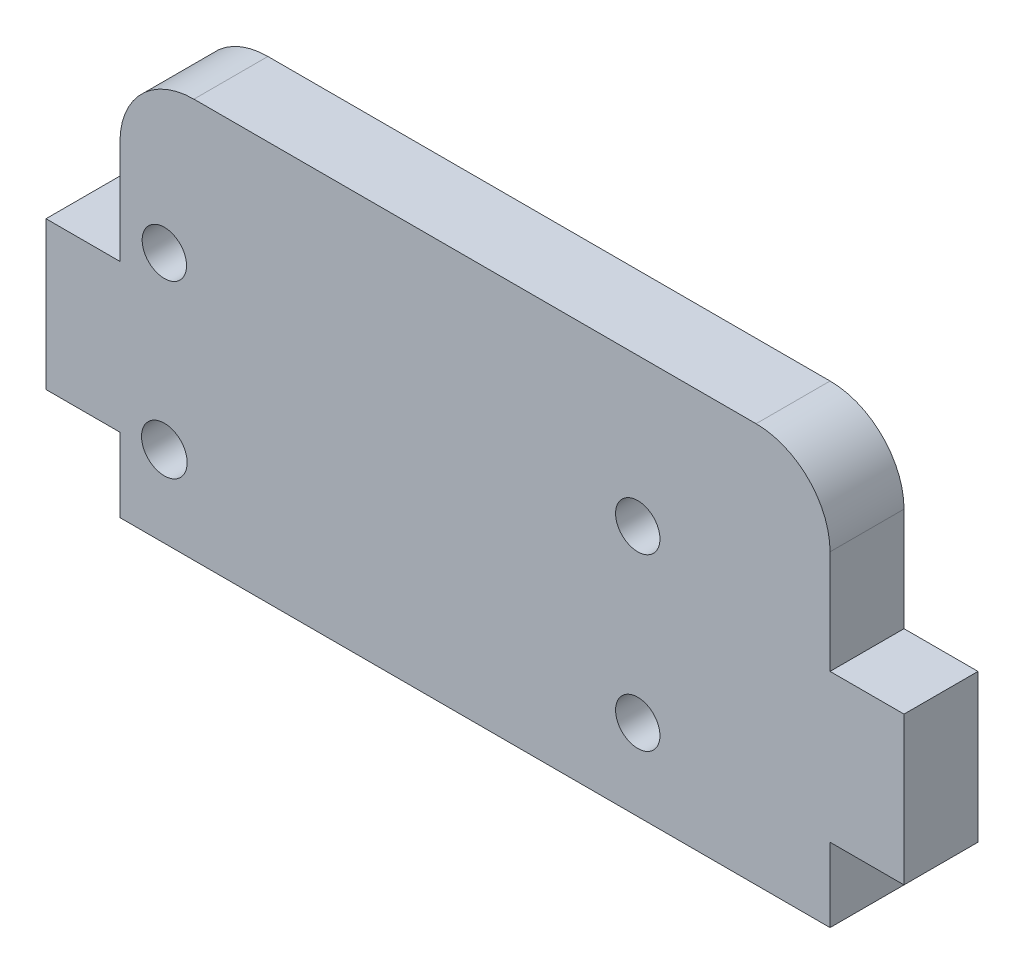
ISO-10303-21;
HEADER;
FILE_DESCRIPTION(('STEP AP214'),'2;1');
FILE_NAME('part.step','',(''),(''),'','','');
FILE_SCHEMA(('AUTOMOTIVE_DESIGN { 1 0 10303 214 1 1 1 1 }'));
ENDSEC;
DATA;
#1=APPLICATION_CONTEXT('core data for automotive mechanical design processes');
#2=APPLICATION_PROTOCOL_DEFINITION('international standard','automotive_design',2000,#1);
#3=PRODUCT_CONTEXT('',#1,'mechanical');
#4=PRODUCT('Part','Part','',(#3));
#5=PRODUCT_RELATED_PRODUCT_CATEGORY('part','',(#4));
#6=PRODUCT_DEFINITION_FORMATION('','',#4);
#7=PRODUCT_DEFINITION_CONTEXT('part definition',#1,'design');
#8=PRODUCT_DEFINITION('design','',#6,#7);
#9=PRODUCT_DEFINITION_SHAPE('','',#8);
#10=(LENGTH_UNIT() NAMED_UNIT(*) SI_UNIT(.MILLI.,.METRE.));
#11=(NAMED_UNIT(*) PLANE_ANGLE_UNIT() SI_UNIT($,.RADIAN.));
#12=(NAMED_UNIT(*) SI_UNIT($,.STERADIAN.) SOLID_ANGLE_UNIT());
#13=UNCERTAINTY_MEASURE_WITH_UNIT(LENGTH_MEASURE(1.E-05),#10,'distance_accuracy_value','');
#14=(GEOMETRIC_REPRESENTATION_CONTEXT(3) GLOBAL_UNCERTAINTY_ASSIGNED_CONTEXT((#13)) GLOBAL_UNIT_ASSIGNED_CONTEXT((#10,
#11,#12)) REPRESENTATION_CONTEXT('',''));
#15=CARTESIAN_POINT('',(0.,0.,0.));
#16=DIRECTION('',(0.,0.,1.));
#17=DIRECTION('',(1.,0.,0.));
#18=AXIS2_PLACEMENT_3D('',#15,#16,#17);
#19=CARTESIAN_POINT('',(23.2664756446991,22.,5.));
#20=DIRECTION('',(0.,0.,-1.));
#21=DIRECTION('',(-1.,0.,0.));
#22=AXIS2_PLACEMENT_3D('',#19,#20,#21);
#23=CYLINDRICAL_SURFACE('',#22,5.);
#24=DIRECTION('',(0.,0.,-1.));
#25=VECTOR('',#24,1.);
#26=CARTESIAN_POINT('',(23.2664756446991,27.,5.));
#27=LINE('',#26,#25);
#28=CARTESIAN_POINT('',(23.2664756446991,27.,5.));
#29=VERTEX_POINT('',#28);
#30=CARTESIAN_POINT('',(23.2664756446991,27.,0.));
#31=VERTEX_POINT('',#30);
#32=EDGE_CURVE('E174',#29,#31,#27,.T.);
#33=ORIENTED_EDGE('',*,*,#32,.F.);
#34=CARTESIAN_POINT('',(23.2664756446991,22.,5.));
#35=DIRECTION('',(0.,0.,1.));
#36=DIRECTION('',(1.,0.,0.));
#37=AXIS2_PLACEMENT_3D('',#34,#35,#36);
#38=CIRCLE('',#37,5.);
#39=CARTESIAN_POINT('',(28.2664756446991,22.,5.));
#40=VERTEX_POINT('',#39);
#41=EDGE_CURVE('E40',#40,#29,#38,.T.);
#42=ORIENTED_EDGE('',*,*,#41,.F.);
#43=DIRECTION('',(0.,0.,-1.));
#44=VECTOR('',#43,1.);
#45=CARTESIAN_POINT('',(28.2664756446991,22.,5.));
#46=LINE('',#45,#44);
#47=CARTESIAN_POINT('',(28.2664756446991,22.,0.));
#48=VERTEX_POINT('',#47);
#49=EDGE_CURVE('E177',#48,#40,#46,.F.);
#50=ORIENTED_EDGE('',*,*,#49,.F.);
#51=CARTESIAN_POINT('',(23.2664756446991,22.,0.));
#52=DIRECTION('',(0.,0.,1.));
#53=DIRECTION('',(1.,0.,0.));
#54=AXIS2_PLACEMENT_3D('',#51,#52,#53);
#55=CIRCLE('',#54,5.);
#56=EDGE_CURVE('E11',#31,#48,#55,.F.);
#57=ORIENTED_EDGE('',*,*,#56,.F.);
#58=EDGE_LOOP('',(#33,#42,#50,#57));
#59=FACE_BOUND('',#58,.T.);
#60=ADVANCED_FACE('F33',(#59),#23,.T.);
#61=CARTESIAN_POINT('',(-14.7335243553009,22.,5.));
#62=DIRECTION('',(0.,0.,1.));
#63=DIRECTION('',(1.,0.,0.));
#64=AXIS2_PLACEMENT_3D('',#61,#62,#63);
#65=CYLINDRICAL_SURFACE('',#64,5.);
#66=DIRECTION('',(0.,0.,1.));
#67=VECTOR('',#66,1.);
#68=CARTESIAN_POINT('',(-14.7335243553009,27.,5.));
#69=LINE('',#68,#67);
#70=CARTESIAN_POINT('',(-14.7335243553009,27.,0.));
#71=VERTEX_POINT('',#70);
#72=CARTESIAN_POINT('',(-14.7335243553009,27.,5.));
#73=VERTEX_POINT('',#72);
#74=EDGE_CURVE('E158',#71,#73,#69,.T.);
#75=ORIENTED_EDGE('',*,*,#74,.F.);
#76=CARTESIAN_POINT('',(-14.7335243553009,22.,0.));
#77=DIRECTION('',(0.,0.,1.));
#78=DIRECTION('',(1.,0.,0.));
#79=AXIS2_PLACEMENT_3D('',#76,#77,#78);
#80=CIRCLE('',#79,5.);
#81=CARTESIAN_POINT('',(-19.7335243553009,22.,0.));
#82=VERTEX_POINT('',#81);
#83=EDGE_CURVE('E169',#82,#71,#80,.F.);
#84=ORIENTED_EDGE('',*,*,#83,.F.);
#85=DIRECTION('',(0.,0.,1.));
#86=VECTOR('',#85,1.);
#87=CARTESIAN_POINT('',(-19.7335243553009,22.,5.));
#88=LINE('',#87,#86);
#89=CARTESIAN_POINT('',(-19.7335243553009,22.,5.));
#90=VERTEX_POINT('',#89);
#91=EDGE_CURVE('E161',#90,#82,#88,.F.);
#92=ORIENTED_EDGE('',*,*,#91,.F.);
#93=CARTESIAN_POINT('',(-14.7335243553009,22.,5.));
#94=DIRECTION('',(0.,0.,1.));
#95=DIRECTION('',(1.,0.,0.));
#96=AXIS2_PLACEMENT_3D('',#93,#94,#95);
#97=CIRCLE('',#96,5.);
#98=EDGE_CURVE('E172',#73,#90,#97,.T.);
#99=ORIENTED_EDGE('',*,*,#98,.F.);
#100=EDGE_LOOP('',(#75,#84,#92,#99));
#101=FACE_BOUND('',#100,.T.);
#102=ADVANCED_FACE('F296',(#101),#65,.T.);
#103=CARTESIAN_POINT('',(0.,0.,5.));
#104=DIRECTION('',(0.,0.,1.));
#105=DIRECTION('',(1.,0.,0.));
#106=AXIS2_PLACEMENT_3D('',#103,#104,#105);
#107=PLANE('',#106);
#108=CARTESIAN_POINT('',(-16.7335243553009,17.,5.));
#109=DIRECTION('',(0.,0.,1.));
#110=DIRECTION('',(1.,0.,0.));
#111=AXIS2_PLACEMENT_3D('',#108,#109,#110);
#112=CIRCLE('',#111,1.5);
#113=CARTESIAN_POINT('',(-15.2335243553009,17.,5.));
#114=VERTEX_POINT('',#113);
#115=EDGE_CURVE('E277',#114,#114,#112,.T.);
#116=ORIENTED_EDGE('',*,*,#115,.F.);
#117=EDGE_LOOP('',(#116));
#118=FACE_BOUND('',#117,.T.);
#119=CARTESIAN_POINT('',(-16.7335243563212,5.48859934850113,5.));
#120=DIRECTION('',(0.,0.,1.));
#121=DIRECTION('',(1.,0.,0.));
#122=AXIS2_PLACEMENT_3D('',#119,#120,#121);
#123=CIRCLE('',#122,1.54291872443539);
#124=CARTESIAN_POINT('',(-15.1906056318858,5.48859934850113,5.));
#125=VERTEX_POINT('',#124);
#126=EDGE_CURVE('E201',#125,#125,#123,.T.);
#127=ORIENTED_EDGE('',*,*,#126,.F.);
#128=EDGE_LOOP('',(#127));
#129=FACE_BOUND('',#128,.T.);
#130=DIRECTION('',(0.,1.,0.));
#131=VECTOR('',#130,1.);
#132=CARTESIAN_POINT('',(28.2664756446991,15.,5.));
#133=LINE('',#132,#131);
#134=CARTESIAN_POINT('',(28.2664756446991,15.,5.));
#135=VERTEX_POINT('',#134);
#136=EDGE_CURVE('E182',#135,#40,#133,.T.);
#137=ORIENTED_EDGE('',*,*,#136,.T.);
#138=ORIENTED_EDGE('',*,*,#41,.T.);
#139=DIRECTION('',(-1.,0.,0.));
#140=VECTOR('',#139,1.);
#141=CARTESIAN_POINT('',(-19.7335243553009,27.,5.));
#142=LINE('',#141,#140);
#143=EDGE_CURVE('E179',#29,#73,#142,.T.);
#144=ORIENTED_EDGE('',*,*,#143,.T.);
#145=ORIENTED_EDGE('',*,*,#98,.T.);
#146=DIRECTION('',(0.,-1.,0.));
#147=VECTOR('',#146,1.);
#148=CARTESIAN_POINT('',(-19.7335243553009,15.,5.));
#149=LINE('',#148,#147);
#150=CARTESIAN_POINT('',(-19.7335243553009,15.,5.));
#151=VERTEX_POINT('',#150);
#152=EDGE_CURVE('E186',#90,#151,#149,.T.);
#153=ORIENTED_EDGE('',*,*,#152,.T.);
#154=DIRECTION('',(-1.,0.,0.));
#155=VECTOR('',#154,1.);
#156=CARTESIAN_POINT('',(-24.7335243553009,15.,5.));
#157=LINE('',#156,#155);
#158=CARTESIAN_POINT('',(-24.7335243553009,15.,5.));
#159=VERTEX_POINT('',#158);
#160=EDGE_CURVE('E188',#151,#159,#157,.T.);
#161=ORIENTED_EDGE('',*,*,#160,.T.);
#162=DIRECTION('',(0.,-1.,0.));
#163=VECTOR('',#162,1.);
#164=CARTESIAN_POINT('',(-24.7335243553009,5.,5.));
#165=LINE('',#164,#163);
#166=CARTESIAN_POINT('',(-24.7335243553009,5.,5.));
#167=VERTEX_POINT('',#166);
#168=EDGE_CURVE('E195',#159,#167,#165,.T.);
#169=ORIENTED_EDGE('',*,*,#168,.T.);
#170=DIRECTION('',(1.,0.,0.));
#171=VECTOR('',#170,1.);
#172=CARTESIAN_POINT('',(-19.7335243553009,5.,5.));
#173=LINE('',#172,#171);
#174=CARTESIAN_POINT('',(-19.7335243553009,5.,5.));
#175=VERTEX_POINT('',#174);
#176=EDGE_CURVE('E149',#167,#175,#173,.T.);
#177=ORIENTED_EDGE('',*,*,#176,.T.);
#178=DIRECTION('',(0.,-1.,0.));
#179=VECTOR('',#178,1.);
#180=CARTESIAN_POINT('',(-19.7335243553009,0.,5.));
#181=LINE('',#180,#179);
#182=CARTESIAN_POINT('',(-19.7335243553009,0.,5.));
#183=VERTEX_POINT('',#182);
#184=EDGE_CURVE('E142',#175,#183,#181,.T.);
#185=ORIENTED_EDGE('',*,*,#184,.T.);
#186=DIRECTION('',(1.,0.,0.));
#187=VECTOR('',#186,1.);
#188=CARTESIAN_POINT('',(-19.7335243553009,0.,5.));
#189=LINE('',#188,#187);
#190=CARTESIAN_POINT('',(28.2664756446991,0.,5.));
#191=VERTEX_POINT('',#190);
#192=EDGE_CURVE('E131',#183,#191,#189,.T.);
#193=ORIENTED_EDGE('',*,*,#192,.T.);
#194=DIRECTION('',(0.,1.,0.));
#195=VECTOR('',#194,1.);
#196=CARTESIAN_POINT('',(28.2664756446991,0.,5.));
#197=LINE('',#196,#195);
#198=CARTESIAN_POINT('',(28.2664756446991,5.,5.));
#199=VERTEX_POINT('',#198);
#200=EDGE_CURVE('E141',#191,#199,#197,.T.);
#201=ORIENTED_EDGE('',*,*,#200,.T.);
#202=DIRECTION('',(1.,0.,0.));
#203=VECTOR('',#202,1.);
#204=CARTESIAN_POINT('',(28.2664756446991,5.,5.));
#205=LINE('',#204,#203);
#206=CARTESIAN_POINT('',(33.2664756446991,5.,5.));
#207=VERTEX_POINT('',#206);
#208=EDGE_CURVE('E248',#199,#207,#205,.T.);
#209=ORIENTED_EDGE('',*,*,#208,.T.);
#210=DIRECTION('',(0.,1.,0.));
#211=VECTOR('',#210,1.);
#212=CARTESIAN_POINT('',(33.2664756446991,5.,5.));
#213=LINE('',#212,#211);
#214=CARTESIAN_POINT('',(33.2664756446991,15.,5.));
#215=VERTEX_POINT('',#214);
#216=EDGE_CURVE('E263',#207,#215,#213,.T.);
#217=ORIENTED_EDGE('',*,*,#216,.T.);
#218=DIRECTION('',(-1.,0.,0.));
#219=VECTOR('',#218,1.);
#220=CARTESIAN_POINT('',(33.2664756446991,15.,5.));
#221=LINE('',#220,#219);
#222=EDGE_CURVE('E190',#215,#135,#221,.T.);
#223=ORIENTED_EDGE('',*,*,#222,.T.);
#224=EDGE_LOOP('',(#137,#138,#144,#145,#153,#161,#169,#177,#185,#193,#201,#209,#217,#223));
#225=FACE_BOUND('',#224,.T.);
#226=CARTESIAN_POINT('',(15.2664756436836,16.9999999999535,5.));
#227=DIRECTION('',(0.,0.,1.));
#228=DIRECTION('',(1.,0.,0.));
#229=AXIS2_PLACEMENT_3D('',#226,#227,#228);
#230=CIRCLE('',#229,1.50000000099755);
#231=CARTESIAN_POINT('',(16.7664756446812,16.9999999999535,5.));
#232=VERTEX_POINT('',#231);
#233=EDGE_CURVE('E271',#232,#232,#230,.T.);
#234=ORIENTED_EDGE('',*,*,#233,.F.);
#235=EDGE_LOOP('',(#234));
#236=FACE_BOUND('',#235,.T.);
#237=CARTESIAN_POINT('',(15.2664756436788,5.48859934848776,5.));
#238=DIRECTION('',(0.,0.,1.));
#239=DIRECTION('',(1.,0.,0.));
#240=AXIS2_PLACEMENT_3D('',#237,#238,#239);
#241=CIRCLE('',#240,1.50000000100247);
#242=CARTESIAN_POINT('',(16.7664756446813,5.48859934848776,5.));
#243=VERTEX_POINT('',#242);
#244=EDGE_CURVE('E283',#243,#243,#241,.T.);
#245=ORIENTED_EDGE('',*,*,#244,.F.);
#246=EDGE_LOOP('',(#245));
#247=FACE_BOUND('',#246,.T.);
#248=ADVANCED_FACE('F146',(#118,#129,#225,#236,#247),#107,.T.);
#249=CARTESIAN_POINT('',(0.,0.,0.));
#250=DIRECTION('',(0.,0.,1.));
#251=DIRECTION('',(1.,0.,0.));
#252=AXIS2_PLACEMENT_3D('',#249,#250,#251);
#253=PLANE('',#252);
#254=DIRECTION('',(-1.,0.,0.));
#255=VECTOR('',#254,1.);
#256=CARTESIAN_POINT('',(-19.7335243553009,27.,0.));
#257=LINE('',#256,#255);
#258=EDGE_CURVE('E214',#31,#71,#257,.T.);
#259=ORIENTED_EDGE('',*,*,#258,.F.);
#260=ORIENTED_EDGE('',*,*,#56,.T.);
#261=DIRECTION('',(0.,1.,0.));
#262=VECTOR('',#261,1.);
#263=CARTESIAN_POINT('',(28.2664756446991,15.,0.));
#264=LINE('',#263,#262);
#265=CARTESIAN_POINT('',(28.2664756446991,15.,0.));
#266=VERTEX_POINT('',#265);
#267=EDGE_CURVE('E211',#266,#48,#264,.T.);
#268=ORIENTED_EDGE('',*,*,#267,.F.);
#269=DIRECTION('',(-1.,0.,0.));
#270=VECTOR('',#269,1.);
#271=CARTESIAN_POINT('',(33.2664756446991,15.,0.));
#272=LINE('',#271,#270);
#273=CARTESIAN_POINT('',(33.2664756446991,15.,0.));
#274=VERTEX_POINT('',#273);
#275=EDGE_CURVE('E209',#274,#266,#272,.T.);
#276=ORIENTED_EDGE('',*,*,#275,.F.);
#277=DIRECTION('',(0.,1.,0.));
#278=VECTOR('',#277,1.);
#279=CARTESIAN_POINT('',(33.2664756446991,5.,0.));
#280=LINE('',#279,#278);
#281=CARTESIAN_POINT('',(33.2664756446991,5.,0.));
#282=VERTEX_POINT('',#281);
#283=EDGE_CURVE('E207',#282,#274,#280,.T.);
#284=ORIENTED_EDGE('',*,*,#283,.F.);
#285=DIRECTION('',(1.,0.,0.));
#286=VECTOR('',#285,1.);
#287=CARTESIAN_POINT('',(28.2664756446991,5.,0.));
#288=LINE('',#287,#286);
#289=CARTESIAN_POINT('',(28.2664756446991,5.,0.));
#290=VERTEX_POINT('',#289);
#291=EDGE_CURVE('E205',#290,#282,#288,.T.);
#292=ORIENTED_EDGE('',*,*,#291,.F.);
#293=DIRECTION('',(0.,1.,0.));
#294=VECTOR('',#293,1.);
#295=CARTESIAN_POINT('',(28.2664756446991,0.,0.));
#296=LINE('',#295,#294);
#297=CARTESIAN_POINT('',(28.2664756446991,0.,0.));
#298=VERTEX_POINT('',#297);
#299=EDGE_CURVE('E203',#298,#290,#296,.T.);
#300=ORIENTED_EDGE('',*,*,#299,.F.);
#301=DIRECTION('',(1.,0.,0.));
#302=VECTOR('',#301,1.);
#303=CARTESIAN_POINT('',(-19.7335243553009,0.,0.));
#304=LINE('',#303,#302);
#305=CARTESIAN_POINT('',(-19.7335243553009,0.,0.));
#306=VERTEX_POINT('',#305);
#307=EDGE_CURVE('E200',#306,#298,#304,.T.);
#308=ORIENTED_EDGE('',*,*,#307,.F.);
#309=DIRECTION('',(0.,-1.,0.));
#310=VECTOR('',#309,1.);
#311=CARTESIAN_POINT('',(-19.7335243553009,0.,0.));
#312=LINE('',#311,#310);
#313=CARTESIAN_POINT('',(-19.7335243553009,5.,0.));
#314=VERTEX_POINT('',#313);
#315=EDGE_CURVE('E157',#314,#306,#312,.T.);
#316=ORIENTED_EDGE('',*,*,#315,.F.);
#317=DIRECTION('',(1.,0.,0.));
#318=VECTOR('',#317,1.);
#319=CARTESIAN_POINT('',(-19.7335243553009,5.,0.));
#320=LINE('',#319,#318);
#321=CARTESIAN_POINT('',(-24.7335243553009,5.,0.));
#322=VERTEX_POINT('',#321);
#323=EDGE_CURVE('E153',#322,#314,#320,.T.);
#324=ORIENTED_EDGE('',*,*,#323,.F.);
#325=DIRECTION('',(0.,-1.,0.));
#326=VECTOR('',#325,1.);
#327=CARTESIAN_POINT('',(-24.7335243553009,5.,0.));
#328=LINE('',#327,#326);
#329=CARTESIAN_POINT('',(-24.7335243553009,15.,0.));
#330=VERTEX_POINT('',#329);
#331=EDGE_CURVE('E220',#330,#322,#328,.T.);
#332=ORIENTED_EDGE('',*,*,#331,.F.);
#333=DIRECTION('',(-1.,0.,0.));
#334=VECTOR('',#333,1.);
#335=CARTESIAN_POINT('',(-24.7335243553009,15.,0.));
#336=LINE('',#335,#334);
#337=CARTESIAN_POINT('',(-19.7335243553009,15.,0.));
#338=VERTEX_POINT('',#337);
#339=EDGE_CURVE('E218',#338,#330,#336,.T.);
#340=ORIENTED_EDGE('',*,*,#339,.F.);
#341=DIRECTION('',(0.,-1.,0.));
#342=VECTOR('',#341,1.);
#343=CARTESIAN_POINT('',(-19.7335243553009,15.,0.));
#344=LINE('',#343,#342);
#345=EDGE_CURVE('E216',#82,#338,#344,.T.);
#346=ORIENTED_EDGE('',*,*,#345,.F.);
#347=ORIENTED_EDGE('',*,*,#83,.T.);
#348=EDGE_LOOP('',(#259,#260,#268,#276,#284,#292,#300,#308,#316,#324,#332,#340,#346,#347));
#349=FACE_BOUND('',#348,.T.);
#350=CARTESIAN_POINT('',(-16.7335243563212,5.48859934850113,0.));
#351=DIRECTION('',(0.,0.,1.));
#352=DIRECTION('',(1.,0.,0.));
#353=AXIS2_PLACEMENT_3D('',#350,#351,#352);
#354=CIRCLE('',#353,1.54291872443539);
#355=CARTESIAN_POINT('',(-15.1906056318858,5.48859934850113,0.));
#356=VERTEX_POINT('',#355);
#357=EDGE_CURVE('E268',#356,#356,#354,.T.);
#358=ORIENTED_EDGE('',*,*,#357,.T.);
#359=EDGE_LOOP('',(#358));
#360=FACE_BOUND('',#359,.T.);
#361=CARTESIAN_POINT('',(15.2664756436836,16.9999999999535,0.));
#362=DIRECTION('',(0.,0.,1.));
#363=DIRECTION('',(1.,0.,0.));
#364=AXIS2_PLACEMENT_3D('',#361,#362,#363);
#365=CIRCLE('',#364,1.50000000099755);
#366=CARTESIAN_POINT('',(16.7664756446812,16.9999999999535,0.));
#367=VERTEX_POINT('',#366);
#368=EDGE_CURVE('E274',#367,#367,#365,.T.);
#369=ORIENTED_EDGE('',*,*,#368,.T.);
#370=EDGE_LOOP('',(#369));
#371=FACE_BOUND('',#370,.T.);
#372=CARTESIAN_POINT('',(-16.7335243553009,17.,0.));
#373=DIRECTION('',(0.,0.,1.));
#374=DIRECTION('',(1.,0.,0.));
#375=AXIS2_PLACEMENT_3D('',#372,#373,#374);
#376=CIRCLE('',#375,1.5);
#377=CARTESIAN_POINT('',(-15.2335243553009,17.,0.));
#378=VERTEX_POINT('',#377);
#379=EDGE_CURVE('E280',#378,#378,#376,.T.);
#380=ORIENTED_EDGE('',*,*,#379,.T.);
#381=EDGE_LOOP('',(#380));
#382=FACE_BOUND('',#381,.T.);
#383=CARTESIAN_POINT('',(15.2664756436788,5.48859934848776,0.));
#384=DIRECTION('',(0.,0.,1.));
#385=DIRECTION('',(1.,0.,0.));
#386=AXIS2_PLACEMENT_3D('',#383,#384,#385);
#387=CIRCLE('',#386,1.50000000100247);
#388=CARTESIAN_POINT('',(16.7664756446813,5.48859934848776,0.));
#389=VERTEX_POINT('',#388);
#390=EDGE_CURVE('E286',#389,#389,#387,.T.);
#391=ORIENTED_EDGE('',*,*,#390,.T.);
#392=EDGE_LOOP('',(#391));
#393=FACE_BOUND('',#392,.T.);
#394=ADVANCED_FACE('F252',(#349,#360,#371,#382,#393),#253,.F.);
#395=CARTESIAN_POINT('',(-19.7335243553009,0.,5.));
#396=DIRECTION('',(1.,0.,0.));
#397=DIRECTION('',(0.,1.,0.));
#398=AXIS2_PLACEMENT_3D('',#395,#396,#397);
#399=PLANE('',#398);
#400=ORIENTED_EDGE('',*,*,#315,.T.);
#401=DIRECTION('',(0.,0.,-1.));
#402=VECTOR('',#401,1.);
#403=CARTESIAN_POINT('',(-19.7335243553009,0.,5.));
#404=LINE('',#403,#402);
#405=EDGE_CURVE('E135',#183,#306,#404,.T.);
#406=ORIENTED_EDGE('',*,*,#405,.F.);
#407=ORIENTED_EDGE('',*,*,#184,.F.);
#408=DIRECTION('',(0.,0.,-1.));
#409=VECTOR('',#408,1.);
#410=CARTESIAN_POINT('',(-19.7335243553009,5.,5.));
#411=LINE('',#410,#409);
#412=EDGE_CURVE('E198',#175,#314,#411,.T.);
#413=ORIENTED_EDGE('',*,*,#412,.T.);
#414=EDGE_LOOP('',(#400,#406,#407,#413));
#415=FACE_BOUND('',#414,.T.);
#416=ADVANCED_FACE('F155',(#415),#399,.F.);
#417=CARTESIAN_POINT('',(-19.7335243553009,0.,5.));
#418=DIRECTION('',(0.,1.,0.));
#419=DIRECTION('',(0.,0.,1.));
#420=AXIS2_PLACEMENT_3D('',#417,#418,#419);
#421=PLANE('',#420);
#422=ORIENTED_EDGE('',*,*,#307,.T.);
#423=DIRECTION('',(0.,0.,-1.));
#424=VECTOR('',#423,1.);
#425=CARTESIAN_POINT('',(28.2664756446991,0.,5.));
#426=LINE('',#425,#424);
#427=EDGE_CURVE('E138',#191,#298,#426,.T.);
#428=ORIENTED_EDGE('',*,*,#427,.F.);
#429=ORIENTED_EDGE('',*,*,#192,.F.);
#430=ORIENTED_EDGE('',*,*,#405,.T.);
#431=EDGE_LOOP('',(#422,#428,#429,#430));
#432=FACE_BOUND('',#431,.T.);
#433=ADVANCED_FACE('F133',(#432),#421,.F.);
#434=CARTESIAN_POINT('',(28.2664756446991,0.,5.));
#435=DIRECTION('',(-1.,0.,0.));
#436=DIRECTION('',(0.,-1.,0.));
#437=AXIS2_PLACEMENT_3D('',#434,#435,#436);
#438=PLANE('',#437);
#439=ORIENTED_EDGE('',*,*,#299,.T.);
#440=DIRECTION('',(0.,0.,-1.));
#441=VECTOR('',#440,1.);
#442=CARTESIAN_POINT('',(28.2664756446991,5.,5.));
#443=LINE('',#442,#441);
#444=EDGE_CURVE('E163',#199,#290,#443,.T.);
#445=ORIENTED_EDGE('',*,*,#444,.F.);
#446=ORIENTED_EDGE('',*,*,#200,.F.);
#447=ORIENTED_EDGE('',*,*,#427,.T.);
#448=EDGE_LOOP('',(#439,#445,#446,#447));
#449=FACE_BOUND('',#448,.T.);
#450=ADVANCED_FACE('F425',(#449),#438,.F.);
#451=CARTESIAN_POINT('',(28.2664756446991,5.,5.));
#452=DIRECTION('',(0.,1.,0.));
#453=DIRECTION('',(0.,0.,1.));
#454=AXIS2_PLACEMENT_3D('',#451,#452,#453);
#455=PLANE('',#454);
#456=ORIENTED_EDGE('',*,*,#291,.T.);
#457=DIRECTION('',(0.,0.,-1.));
#458=VECTOR('',#457,1.);
#459=CARTESIAN_POINT('',(33.2664756446991,5.,5.));
#460=LINE('',#459,#458);
#461=EDGE_CURVE('E239',#207,#282,#460,.T.);
#462=ORIENTED_EDGE('',*,*,#461,.F.);
#463=ORIENTED_EDGE('',*,*,#208,.F.);
#464=ORIENTED_EDGE('',*,*,#444,.T.);
#465=EDGE_LOOP('',(#456,#462,#463,#464));
#466=FACE_BOUND('',#465,.T.);
#467=ADVANCED_FACE('F246',(#466),#455,.F.);
#468=CARTESIAN_POINT('',(33.2664756446991,5.,5.));
#469=DIRECTION('',(-1.,0.,0.));
#470=DIRECTION('',(0.,0.,1.));
#471=AXIS2_PLACEMENT_3D('',#468,#469,#470);
#472=PLANE('',#471);
#473=ORIENTED_EDGE('',*,*,#283,.T.);
#474=DIRECTION('',(0.,0.,-1.));
#475=VECTOR('',#474,1.);
#476=CARTESIAN_POINT('',(33.2664756446991,15.,5.));
#477=LINE('',#476,#475);
#478=EDGE_CURVE('E236',#215,#274,#477,.T.);
#479=ORIENTED_EDGE('',*,*,#478,.F.);
#480=ORIENTED_EDGE('',*,*,#216,.F.);
#481=ORIENTED_EDGE('',*,*,#461,.T.);
#482=EDGE_LOOP('',(#473,#479,#480,#481));
#483=FACE_BOUND('',#482,.T.);
#484=ADVANCED_FACE('F257',(#483),#472,.F.);
#485=CARTESIAN_POINT('',(33.2664756446991,15.,5.));
#486=DIRECTION('',(0.,-1.,0.));
#487=DIRECTION('',(0.,0.,-1.));
#488=AXIS2_PLACEMENT_3D('',#485,#486,#487);
#489=PLANE('',#488);
#490=ORIENTED_EDGE('',*,*,#275,.T.);
#491=DIRECTION('',(0.,0.,-1.));
#492=VECTOR('',#491,1.);
#493=CARTESIAN_POINT('',(28.2664756446991,15.,5.));
#494=LINE('',#493,#492);
#495=EDGE_CURVE('E233',#135,#266,#494,.T.);
#496=ORIENTED_EDGE('',*,*,#495,.F.);
#497=ORIENTED_EDGE('',*,*,#222,.F.);
#498=ORIENTED_EDGE('',*,*,#478,.T.);
#499=EDGE_LOOP('',(#490,#496,#497,#498));
#500=FACE_BOUND('',#499,.T.);
#501=ADVANCED_FACE('F261',(#500),#489,.F.);
#502=CARTESIAN_POINT('',(28.2664756446991,15.,5.));
#503=DIRECTION('',(-1.,0.,0.));
#504=DIRECTION('',(0.,-1.,0.));
#505=AXIS2_PLACEMENT_3D('',#502,#503,#504);
#506=PLANE('',#505);
#507=ORIENTED_EDGE('',*,*,#267,.T.);
#508=ORIENTED_EDGE('',*,*,#49,.T.);
#509=ORIENTED_EDGE('',*,*,#136,.F.);
#510=ORIENTED_EDGE('',*,*,#495,.T.);
#511=EDGE_LOOP('',(#507,#508,#509,#510));
#512=FACE_BOUND('',#511,.T.);
#513=ADVANCED_FACE('F416',(#512),#506,.F.);
#514=CARTESIAN_POINT('',(-19.7335243553009,27.,5.));
#515=DIRECTION('',(0.,-1.,0.));
#516=DIRECTION('',(0.,0.,-1.));
#517=AXIS2_PLACEMENT_3D('',#514,#515,#516);
#518=PLANE('',#517);
#519=ORIENTED_EDGE('',*,*,#143,.F.);
#520=ORIENTED_EDGE('',*,*,#32,.T.);
#521=ORIENTED_EDGE('',*,*,#258,.T.);
#522=ORIENTED_EDGE('',*,*,#74,.T.);
#523=EDGE_LOOP('',(#519,#520,#521,#522));
#524=FACE_BOUND('',#523,.T.);
#525=ADVANCED_FACE('F184',(#524),#518,.F.);
#526=CARTESIAN_POINT('',(-19.7335243553009,15.,5.));
#527=DIRECTION('',(1.,0.,0.));
#528=DIRECTION('',(0.,1.,0.));
#529=AXIS2_PLACEMENT_3D('',#526,#527,#528);
#530=PLANE('',#529);
#531=ORIENTED_EDGE('',*,*,#152,.F.);
#532=ORIENTED_EDGE('',*,*,#91,.T.);
#533=ORIENTED_EDGE('',*,*,#345,.T.);
#534=DIRECTION('',(0.,0.,-1.));
#535=VECTOR('',#534,1.);
#536=CARTESIAN_POINT('',(-19.7335243553009,15.,5.));
#537=LINE('',#536,#535);
#538=EDGE_CURVE('E230',#151,#338,#537,.T.);
#539=ORIENTED_EDGE('',*,*,#538,.F.);
#540=EDGE_LOOP('',(#531,#532,#533,#539));
#541=FACE_BOUND('',#540,.T.);
#542=ADVANCED_FACE('F325',(#541),#530,.F.);
#543=CARTESIAN_POINT('',(-24.7335243553009,15.,5.));
#544=DIRECTION('',(0.,-1.,0.));
#545=DIRECTION('',(0.,0.,-1.));
#546=AXIS2_PLACEMENT_3D('',#543,#544,#545);
#547=PLANE('',#546);
#548=ORIENTED_EDGE('',*,*,#339,.T.);
#549=DIRECTION('',(0.,0.,-1.));
#550=VECTOR('',#549,1.);
#551=CARTESIAN_POINT('',(-24.7335243553009,15.,5.));
#552=LINE('',#551,#550);
#553=EDGE_CURVE('E227',#159,#330,#552,.T.);
#554=ORIENTED_EDGE('',*,*,#553,.F.);
#555=ORIENTED_EDGE('',*,*,#160,.F.);
#556=ORIENTED_EDGE('',*,*,#538,.T.);
#557=EDGE_LOOP('',(#548,#554,#555,#556));
#558=FACE_BOUND('',#557,.T.);
#559=ADVANCED_FACE('F329',(#558),#547,.F.);
#560=CARTESIAN_POINT('',(-24.7335243553009,5.,5.));
#561=DIRECTION('',(1.,0.,0.));
#562=DIRECTION('',(0.,0.,-1.));
#563=AXIS2_PLACEMENT_3D('',#560,#561,#562);
#564=PLANE('',#563);
#565=ORIENTED_EDGE('',*,*,#331,.T.);
#566=DIRECTION('',(0.,0.,-1.));
#567=VECTOR('',#566,1.);
#568=CARTESIAN_POINT('',(-24.7335243553009,5.,5.));
#569=LINE('',#568,#567);
#570=EDGE_CURVE('E224',#167,#322,#569,.T.);
#571=ORIENTED_EDGE('',*,*,#570,.F.);
#572=ORIENTED_EDGE('',*,*,#168,.F.);
#573=ORIENTED_EDGE('',*,*,#553,.T.);
#574=EDGE_LOOP('',(#565,#571,#572,#573));
#575=FACE_BOUND('',#574,.T.);
#576=ADVANCED_FACE('F345',(#575),#564,.F.);
#577=CARTESIAN_POINT('',(-19.7335243553009,5.,5.));
#578=DIRECTION('',(0.,1.,0.));
#579=DIRECTION('',(0.,0.,1.));
#580=AXIS2_PLACEMENT_3D('',#577,#578,#579);
#581=PLANE('',#580);
#582=ORIENTED_EDGE('',*,*,#323,.T.);
#583=ORIENTED_EDGE('',*,*,#412,.F.);
#584=ORIENTED_EDGE('',*,*,#176,.F.);
#585=ORIENTED_EDGE('',*,*,#570,.T.);
#586=EDGE_LOOP('',(#582,#583,#584,#585));
#587=FACE_BOUND('',#586,.T.);
#588=ADVANCED_FACE('F353',(#587),#581,.F.);
#589=CARTESIAN_POINT('',(-16.7335243563212,5.48859934850113,5.));
#590=DIRECTION('',(0.,0.,-1.));
#591=DIRECTION('',(-1.,0.,0.));
#592=AXIS2_PLACEMENT_3D('',#589,#590,#591);
#593=CYLINDRICAL_SURFACE('',#592,1.54291872443539);
#594=ORIENTED_EDGE('',*,*,#126,.T.);
#595=EDGE_LOOP('',(#594));
#596=FACE_BOUND('',#595,.T.);
#597=ORIENTED_EDGE('',*,*,#357,.F.);
#598=EDGE_LOOP('',(#597));
#599=FACE_BOUND('',#598,.T.);
#600=ADVANCED_FACE('F361',(#596,#599),#593,.F.);
#601=CARTESIAN_POINT('',(15.2664756436836,16.9999999999535,5.));
#602=DIRECTION('',(0.,0.,-1.));
#603=DIRECTION('',(-1.,0.,0.));
#604=AXIS2_PLACEMENT_3D('',#601,#602,#603);
#605=CYLINDRICAL_SURFACE('',#604,1.50000000099755);
#606=ORIENTED_EDGE('',*,*,#233,.T.);
#607=EDGE_LOOP('',(#606));
#608=FACE_BOUND('',#607,.T.);
#609=ORIENTED_EDGE('',*,*,#368,.F.);
#610=EDGE_LOOP('',(#609));
#611=FACE_BOUND('',#610,.T.);
#612=ADVANCED_FACE('F369',(#608,#611),#605,.F.);
#613=CARTESIAN_POINT('',(-16.7335243553009,17.,5.));
#614=DIRECTION('',(0.,0.,-1.));
#615=DIRECTION('',(-1.,0.,0.));
#616=AXIS2_PLACEMENT_3D('',#613,#614,#615);
#617=CYLINDRICAL_SURFACE('',#616,1.5);
#618=ORIENTED_EDGE('',*,*,#115,.T.);
#619=EDGE_LOOP('',(#618));
#620=FACE_BOUND('',#619,.T.);
#621=ORIENTED_EDGE('',*,*,#379,.F.);
#622=EDGE_LOOP('',(#621));
#623=FACE_BOUND('',#622,.T.);
#624=ADVANCED_FACE('F376',(#620,#623),#617,.F.);
#625=CARTESIAN_POINT('',(15.2664756436788,5.48859934848776,5.));
#626=DIRECTION('',(0.,0.,-1.));
#627=DIRECTION('',(-1.,0.,0.));
#628=AXIS2_PLACEMENT_3D('',#625,#626,#627);
#629=CYLINDRICAL_SURFACE('',#628,1.50000000100247);
#630=ORIENTED_EDGE('',*,*,#244,.T.);
#631=EDGE_LOOP('',(#630));
#632=FACE_BOUND('',#631,.T.);
#633=ORIENTED_EDGE('',*,*,#390,.F.);
#634=EDGE_LOOP('',(#633));
#635=FACE_BOUND('',#634,.T.);
#636=ADVANCED_FACE('F292',(#632,#635),#629,.F.);
#637=CLOSED_SHELL('',(#60,#102,#248,#394,#416,#433,#450,#467,#484,#501,#513,#525,#542,#559,#576,
#588,#600,#612,#624,#636));
#638=MANIFOLD_SOLID_BREP('B2',#637);
#639=ADVANCED_BREP_SHAPE_REPRESENTATION('',(#18,#638),#14);
#640=SHAPE_DEFINITION_REPRESENTATION(#9,#639);
ENDSEC;
END-ISO-10303-21;
